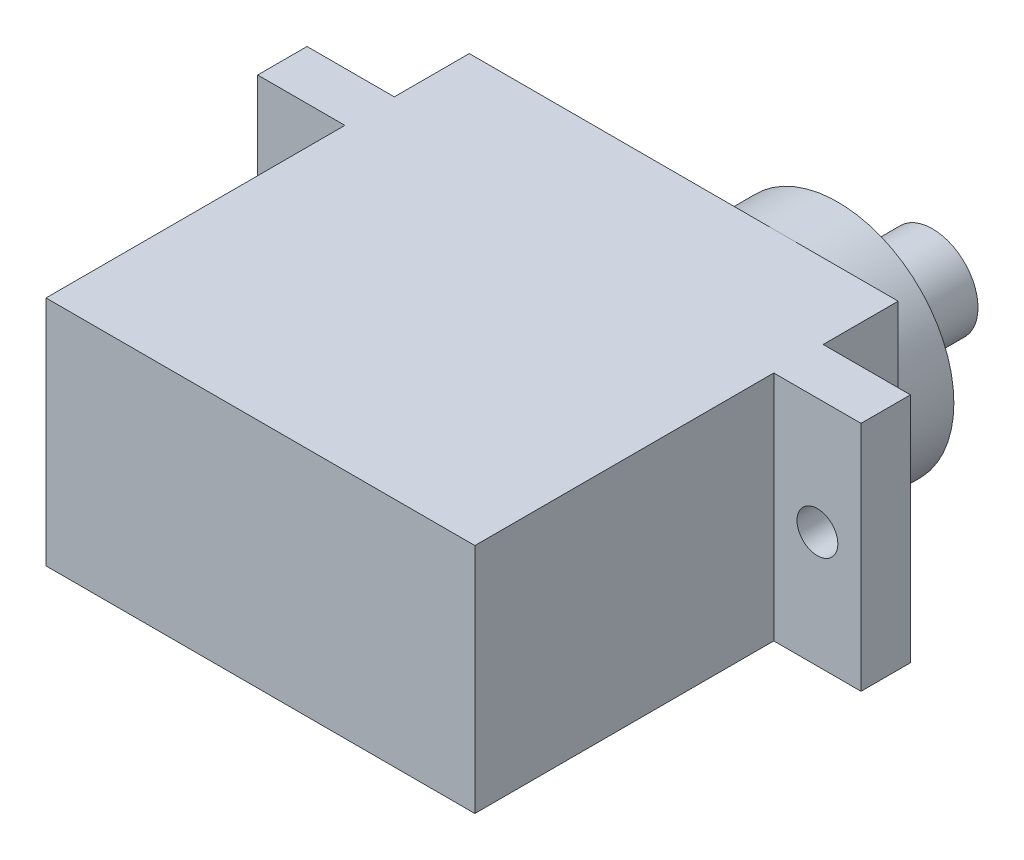
ISO-10303-21;
HEADER;
FILE_DESCRIPTION(('STEP AP214'),'2;1');
FILE_NAME('part.step','',(''),(''),'','','');
FILE_SCHEMA(('AUTOMOTIVE_DESIGN { 1 0 10303 214 1 1 1 1 }'));
ENDSEC;
DATA;
#1=APPLICATION_CONTEXT('core data for automotive mechanical design processes');
#2=APPLICATION_PROTOCOL_DEFINITION('international standard','automotive_design',2000,#1);
#3=PRODUCT_CONTEXT('',#1,'mechanical');
#4=PRODUCT('Part','Part','',(#3));
#5=PRODUCT_RELATED_PRODUCT_CATEGORY('part','',(#4));
#6=PRODUCT_DEFINITION_FORMATION('','',#4);
#7=PRODUCT_DEFINITION_CONTEXT('part definition',#1,'design');
#8=PRODUCT_DEFINITION('design','',#6,#7);
#9=PRODUCT_DEFINITION_SHAPE('','',#8);
#10=(LENGTH_UNIT() NAMED_UNIT(*) SI_UNIT(.MILLI.,.METRE.));
#11=(NAMED_UNIT(*) PLANE_ANGLE_UNIT() SI_UNIT($,.RADIAN.));
#12=(NAMED_UNIT(*) SI_UNIT($,.STERADIAN.) SOLID_ANGLE_UNIT());
#13=UNCERTAINTY_MEASURE_WITH_UNIT(LENGTH_MEASURE(1.E-05),#10,'distance_accuracy_value','');
#14=(GEOMETRIC_REPRESENTATION_CONTEXT(3) GLOBAL_UNCERTAINTY_ASSIGNED_CONTEXT((#13)) GLOBAL_UNIT_ASSIGNED_CONTEXT((#10,
#11,#12)) REPRESENTATION_CONTEXT('',''));
#15=CARTESIAN_POINT('',(0.,0.,0.));
#16=DIRECTION('',(0.,0.,1.));
#17=DIRECTION('',(1.,0.,0.));
#18=AXIS2_PLACEMENT_3D('',#15,#16,#17);
#19=CARTESIAN_POINT('',(0.,0.,-6.7));
#20=DIRECTION('',(0.,0.,1.));
#21=DIRECTION('',(1.,0.,0.));
#22=AXIS2_PLACEMENT_3D('',#19,#20,#21);
#23=PLANE('',#22);
#24=DIRECTION('',(0.,1.,0.));
#25=VECTOR('',#24,1.);
#26=CARTESIAN_POINT('',(27.8,0.,-6.7));
#27=LINE('',#26,#25);
#28=CARTESIAN_POINT('',(27.8,6.25,-6.7));
#29=VERTEX_POINT('',#28);
#30=CARTESIAN_POINT('',(27.8,12.5,-6.7));
#31=VERTEX_POINT('',#30);
#32=EDGE_CURVE('E166',#29,#31,#27,.T.);
#33=ORIENTED_EDGE('',*,*,#32,.F.);
#34=CARTESIAN_POINT('',(21.55,6.25,-6.7));
#35=DIRECTION('',(0.,0.,1.));
#36=DIRECTION('',(1.,0.,0.));
#37=AXIS2_PLACEMENT_3D('',#34,#35,#36);
#38=CIRCLE('',#37,6.25);
#39=CARTESIAN_POINT('',(21.55,12.5,-6.7));
#40=VERTEX_POINT('',#39);
#41=EDGE_CURVE('E12',#29,#40,#38,.T.);
#42=ORIENTED_EDGE('',*,*,#41,.T.);
#43=DIRECTION('',(1.,0.,0.));
#44=VECTOR('',#43,1.);
#45=CARTESIAN_POINT('',(0.,12.5,-6.7));
#46=LINE('',#45,#44);
#47=EDGE_CURVE('E171',#40,#31,#46,.T.);
#48=ORIENTED_EDGE('',*,*,#47,.T.);
#49=EDGE_LOOP('',(#33,#42,#48));
#50=FACE_BOUND('',#49,.T.);
#51=ADVANCED_FACE('F39',(#50),#23,.F.);
#52=CARTESIAN_POINT('',(4.7,12.5,-6.7));
#53=VERTEX_POINT('',#52);
#54=EDGE_CURVE('E152',#53,#40,#46,.T.);
#55=ORIENTED_EDGE('',*,*,#54,.T.);
#56=CARTESIAN_POINT('',(21.55,0.,-6.7));
#57=VERTEX_POINT('',#56);
#58=EDGE_CURVE('E48',#40,#57,#38,.T.);
#59=ORIENTED_EDGE('',*,*,#58,.T.);
#60=DIRECTION('',(1.,0.,0.));
#61=VECTOR('',#60,1.);
#62=CARTESIAN_POINT('',(0.,0.,-6.7));
#63=LINE('',#62,#61);
#64=CARTESIAN_POINT('',(4.7,0.,-6.7));
#65=VERTEX_POINT('',#64);
#66=EDGE_CURVE('E150',#65,#57,#63,.T.);
#67=ORIENTED_EDGE('',*,*,#66,.F.);
#68=DIRECTION('',(0.,1.,0.));
#69=VECTOR('',#68,1.);
#70=CARTESIAN_POINT('',(4.7,0.,-6.7));
#71=LINE('',#70,#69);
#72=EDGE_CURVE('E173',#65,#53,#71,.T.);
#73=ORIENTED_EDGE('',*,*,#72,.T.);
#74=EDGE_LOOP('',(#55,#59,#67,#73));
#75=FACE_BOUND('',#74,.T.);
#76=ADVANCED_FACE('F148',(#75),#23,.F.);
#77=CARTESIAN_POINT('',(0.,0.,-2.66));
#78=DIRECTION('',(0.,0.,1.));
#79=DIRECTION('',(1.,0.,0.));
#80=AXIS2_PLACEMENT_3D('',#77,#78,#79);
#81=PLANE('',#80);
#82=CARTESIAN_POINT('',(2.12941164042014,6.25,-2.66));
#83=DIRECTION('',(0.,0.,-1.));
#84=DIRECTION('',(-1.,0.,0.));
#85=AXIS2_PLACEMENT_3D('',#82,#83,#84);
#86=CIRCLE('',#85,1.1);
#87=CARTESIAN_POINT('',(1.02941164042014,6.25,-2.66));
#88=VERTEX_POINT('',#87);
#89=EDGE_CURVE('E257',#88,#88,#86,.T.);
#90=ORIENTED_EDGE('',*,*,#89,.F.);
#91=EDGE_LOOP('',(#90));
#92=FACE_BOUND('',#91,.T.);
#93=DIRECTION('',(0.,1.,0.));
#94=VECTOR('',#93,1.);
#95=CARTESIAN_POINT('',(4.7,0.,-2.66));
#96=LINE('',#95,#94);
#97=CARTESIAN_POINT('',(4.7,0.,-2.66));
#98=VERTEX_POINT('',#97);
#99=CARTESIAN_POINT('',(4.7,12.5,-2.66));
#100=VERTEX_POINT('',#99);
#101=EDGE_CURVE('E177',#98,#100,#96,.T.);
#102=ORIENTED_EDGE('',*,*,#101,.F.);
#103=DIRECTION('',(1.,0.,0.));
#104=VECTOR('',#103,1.);
#105=CARTESIAN_POINT('',(0.,0.,-2.66));
#106=LINE('',#105,#104);
#107=CARTESIAN_POINT('',(0.,0.,-2.66));
#108=VERTEX_POINT('',#107);
#109=EDGE_CURVE('E198',#108,#98,#106,.T.);
#110=ORIENTED_EDGE('',*,*,#109,.F.);
#111=DIRECTION('',(0.,1.,0.));
#112=VECTOR('',#111,1.);
#113=CARTESIAN_POINT('',(0.,0.,-2.66));
#114=LINE('',#113,#112);
#115=CARTESIAN_POINT('',(0.,12.5,-2.66));
#116=VERTEX_POINT('',#115);
#117=EDGE_CURVE('E195',#108,#116,#114,.T.);
#118=ORIENTED_EDGE('',*,*,#117,.T.);
#119=DIRECTION('',(1.,0.,0.));
#120=VECTOR('',#119,1.);
#121=CARTESIAN_POINT('',(0.,12.5,-2.66));
#122=LINE('',#121,#120);
#123=EDGE_CURVE('E192',#116,#100,#122,.T.);
#124=ORIENTED_EDGE('',*,*,#123,.T.);
#125=EDGE_LOOP('',(#102,#110,#118,#124));
#126=FACE_BOUND('',#125,.T.);
#127=ADVANCED_FACE('F276',(#92,#126),#81,.F.);
#128=CARTESIAN_POINT('',(0.,0.,16.1));
#129=DIRECTION('',(0.,1.,0.));
#130=DIRECTION('',(0.,0.,1.));
#131=AXIS2_PLACEMENT_3D('',#128,#129,#130);
#132=PLANE('',#131);
#133=DIRECTION('',(0.,0.,-1.));
#134=VECTOR('',#133,1.);
#135=CARTESIAN_POINT('',(4.7,0.,16.1));
#136=LINE('',#135,#134);
#137=CARTESIAN_POINT('',(4.7,0.,16.1));
#138=VERTEX_POINT('',#137);
#139=CARTESIAN_POINT('',(4.7,0.,0.));
#140=VERTEX_POINT('',#139);
#141=EDGE_CURVE('E233',#138,#140,#136,.T.);
#142=ORIENTED_EDGE('',*,*,#141,.T.);
#143=DIRECTION('',(1.,0.,0.));
#144=VECTOR('',#143,1.);
#145=CARTESIAN_POINT('',(0.,0.,0.));
#146=LINE('',#145,#144);
#147=CARTESIAN_POINT('',(0.,0.,0.));
#148=VERTEX_POINT('',#147);
#149=EDGE_CURVE('E191',#148,#140,#146,.T.);
#150=ORIENTED_EDGE('',*,*,#149,.F.);
#151=DIRECTION('',(0.,0.,1.));
#152=VECTOR('',#151,1.);
#153=CARTESIAN_POINT('',(0.,0.,-2.66));
#154=LINE('',#153,#152);
#155=EDGE_CURVE('E214',#108,#148,#154,.T.);
#156=ORIENTED_EDGE('',*,*,#155,.F.);
#157=ORIENTED_EDGE('',*,*,#109,.T.);
#158=DIRECTION('',(0.,0.,1.));
#159=VECTOR('',#158,1.);
#160=CARTESIAN_POINT('',(4.7,0.,-6.7));
#161=LINE('',#160,#159);
#162=EDGE_CURVE('E164',#65,#98,#161,.T.);
#163=ORIENTED_EDGE('',*,*,#162,.F.);
#164=ORIENTED_EDGE('',*,*,#66,.T.);
#165=CARTESIAN_POINT('',(27.8,0.,-6.7));
#166=VERTEX_POINT('',#165);
#167=EDGE_CURVE('E153',#57,#166,#63,.T.);
#168=ORIENTED_EDGE('',*,*,#167,.T.);
#169=DIRECTION('',(0.,0.,1.));
#170=VECTOR('',#169,1.);
#171=CARTESIAN_POINT('',(27.8,0.,-6.7));
#172=LINE('',#171,#170);
#173=CARTESIAN_POINT('',(27.8,0.,-2.66));
#174=VERTEX_POINT('',#173);
#175=EDGE_CURVE('E175',#166,#174,#172,.T.);
#176=ORIENTED_EDGE('',*,*,#175,.T.);
#177=CARTESIAN_POINT('',(32.5,0.,-2.66));
#178=VERTEX_POINT('',#177);
#179=EDGE_CURVE('E197',#174,#178,#106,.T.);
#180=ORIENTED_EDGE('',*,*,#179,.T.);
#181=DIRECTION('',(0.,0.,1.));
#182=VECTOR('',#181,1.);
#183=CARTESIAN_POINT('',(32.5,0.,-2.66));
#184=LINE('',#183,#182);
#185=CARTESIAN_POINT('',(32.5,0.,0.));
#186=VERTEX_POINT('',#185);
#187=EDGE_CURVE('E211',#178,#186,#184,.T.);
#188=ORIENTED_EDGE('',*,*,#187,.T.);
#189=CARTESIAN_POINT('',(27.8,0.,0.));
#190=VERTEX_POINT('',#189);
#191=EDGE_CURVE('E209',#190,#186,#146,.T.);
#192=ORIENTED_EDGE('',*,*,#191,.F.);
#193=DIRECTION('',(0.,0.,-1.));
#194=VECTOR('',#193,1.);
#195=CARTESIAN_POINT('',(27.8,0.,16.1));
#196=LINE('',#195,#194);
#197=CARTESIAN_POINT('',(27.8,0.,16.1));
#198=VERTEX_POINT('',#197);
#199=EDGE_CURVE('E244',#198,#190,#196,.T.);
#200=ORIENTED_EDGE('',*,*,#199,.F.);
#201=DIRECTION('',(1.,0.,0.));
#202=VECTOR('',#201,1.);
#203=CARTESIAN_POINT('',(0.,0.,16.1));
#204=LINE('',#203,#202);
#205=EDGE_CURVE('E221',#138,#198,#204,.T.);
#206=ORIENTED_EDGE('',*,*,#205,.F.);
#207=EDGE_LOOP('',(#142,#150,#156,#157,#163,#164,#168,#176,#180,#188,#192,#200,#206));
#208=FACE_BOUND('',#207,.T.);
#209=ADVANCED_FACE('F41',(#208),#132,.F.);
#210=CARTESIAN_POINT('',(27.8,0.,16.1));
#211=DIRECTION('',(-1.,0.,0.));
#212=DIRECTION('',(0.,0.,1.));
#213=AXIS2_PLACEMENT_3D('',#210,#211,#212);
#214=PLANE('',#213);
#215=DIRECTION('',(0.,1.,0.));
#216=VECTOR('',#215,1.);
#217=CARTESIAN_POINT('',(27.8,0.,0.));
#218=LINE('',#217,#216);
#219=CARTESIAN_POINT('',(27.8,6.25,0.));
#220=VERTEX_POINT('',#219);
#221=EDGE_CURVE('E234',#190,#220,#218,.T.);
#222=ORIENTED_EDGE('',*,*,#221,.T.);
#223=CARTESIAN_POINT('',(27.8,12.5,0.));
#224=VERTEX_POINT('',#223);
#225=EDGE_CURVE('E57',#220,#224,#218,.T.);
#226=ORIENTED_EDGE('',*,*,#225,.T.);
#227=DIRECTION('',(0.,0.,-1.));
#228=VECTOR('',#227,1.);
#229=CARTESIAN_POINT('',(27.8,12.5,16.1));
#230=LINE('',#229,#228);
#231=CARTESIAN_POINT('',(27.8,12.5,16.1));
#232=VERTEX_POINT('',#231);
#233=EDGE_CURVE('E241',#232,#224,#230,.T.);
#234=ORIENTED_EDGE('',*,*,#233,.F.);
#235=DIRECTION('',(0.,1.,0.));
#236=VECTOR('',#235,1.);
#237=CARTESIAN_POINT('',(27.8,0.,16.1));
#238=LINE('',#237,#236);
#239=EDGE_CURVE('E224',#198,#232,#238,.T.);
#240=ORIENTED_EDGE('',*,*,#239,.F.);
#241=ORIENTED_EDGE('',*,*,#199,.T.);
#242=EDGE_LOOP('',(#222,#226,#234,#240,#241));
#243=FACE_BOUND('',#242,.T.);
#244=ADVANCED_FACE('F289',(#243),#214,.F.);
#245=CARTESIAN_POINT('',(0.,12.5,16.1));
#246=DIRECTION('',(0.,1.,0.));
#247=DIRECTION('',(0.,0.,1.));
#248=AXIS2_PLACEMENT_3D('',#245,#246,#247);
#249=PLANE('',#248);
#250=ORIENTED_EDGE('',*,*,#233,.T.);
#251=DIRECTION('',(1.,0.,0.));
#252=VECTOR('',#251,1.);
#253=CARTESIAN_POINT('',(0.,12.5,0.));
#254=LINE('',#253,#252);
#255=CARTESIAN_POINT('',(32.5,12.5,0.));
#256=VERTEX_POINT('',#255);
#257=EDGE_CURVE('E203',#224,#256,#254,.T.);
#258=ORIENTED_EDGE('',*,*,#257,.T.);
#259=DIRECTION('',(0.,0.,1.));
#260=VECTOR('',#259,1.);
#261=CARTESIAN_POINT('',(32.5,12.5,-2.66));
#262=LINE('',#261,#260);
#263=CARTESIAN_POINT('',(32.5,12.5,-2.66));
#264=VERTEX_POINT('',#263);
#265=EDGE_CURVE('E200',#264,#256,#262,.T.);
#266=ORIENTED_EDGE('',*,*,#265,.F.);
#267=CARTESIAN_POINT('',(27.8,12.5,-2.66));
#268=VERTEX_POINT('',#267);
#269=EDGE_CURVE('E190',#268,#264,#122,.T.);
#270=ORIENTED_EDGE('',*,*,#269,.F.);
#271=DIRECTION('',(0.,0.,1.));
#272=VECTOR('',#271,1.);
#273=CARTESIAN_POINT('',(27.8,12.5,-6.7));
#274=LINE('',#273,#272);
#275=EDGE_CURVE('E181',#31,#268,#274,.T.);
#276=ORIENTED_EDGE('',*,*,#275,.F.);
#277=ORIENTED_EDGE('',*,*,#47,.F.);
#278=ORIENTED_EDGE('',*,*,#54,.F.);
#279=DIRECTION('',(0.,0.,1.));
#280=VECTOR('',#279,1.);
#281=CARTESIAN_POINT('',(4.7,12.5,-6.7));
#282=LINE('',#281,#280);
#283=EDGE_CURVE('E178',#53,#100,#282,.T.);
#284=ORIENTED_EDGE('',*,*,#283,.T.);
#285=ORIENTED_EDGE('',*,*,#123,.F.);
#286=DIRECTION('',(0.,0.,1.));
#287=VECTOR('',#286,1.);
#288=CARTESIAN_POINT('',(0.,12.5,-2.66));
#289=LINE('',#288,#287);
#290=CARTESIAN_POINT('',(0.,12.5,0.));
#291=VERTEX_POINT('',#290);
#292=EDGE_CURVE('E216',#116,#291,#289,.T.);
#293=ORIENTED_EDGE('',*,*,#292,.T.);
#294=CARTESIAN_POINT('',(4.7,12.5,0.));
#295=VERTEX_POINT('',#294);
#296=EDGE_CURVE('E204',#291,#295,#254,.T.);
#297=ORIENTED_EDGE('',*,*,#296,.T.);
#298=DIRECTION('',(0.,0.,-1.));
#299=VECTOR('',#298,1.);
#300=CARTESIAN_POINT('',(4.7,12.5,16.1));
#301=LINE('',#300,#299);
#302=CARTESIAN_POINT('',(4.7,12.5,16.1));
#303=VERTEX_POINT('',#302);
#304=EDGE_CURVE('E238',#303,#295,#301,.T.);
#305=ORIENTED_EDGE('',*,*,#304,.F.);
#306=DIRECTION('',(1.,0.,0.));
#307=VECTOR('',#306,1.);
#308=CARTESIAN_POINT('',(0.,12.5,16.1));
#309=LINE('',#308,#307);
#310=EDGE_CURVE('E227',#303,#232,#309,.T.);
#311=ORIENTED_EDGE('',*,*,#310,.T.);
#312=EDGE_LOOP('',(#250,#258,#266,#270,#276,#277,#278,#284,#285,#293,#297,#305,#311));
#313=FACE_BOUND('',#312,.T.);
#314=ADVANCED_FACE('F303',(#313),#249,.T.);
#315=CARTESIAN_POINT('',(4.7,0.,16.1));
#316=DIRECTION('',(-1.,0.,0.));
#317=DIRECTION('',(0.,0.,1.));
#318=AXIS2_PLACEMENT_3D('',#315,#316,#317);
#319=PLANE('',#318);
#320=DIRECTION('',(0.,1.,0.));
#321=VECTOR('',#320,1.);
#322=CARTESIAN_POINT('',(4.7,0.,0.));
#323=LINE('',#322,#321);
#324=EDGE_CURVE('E225',#140,#295,#323,.T.);
#325=ORIENTED_EDGE('',*,*,#324,.F.);
#326=ORIENTED_EDGE('',*,*,#141,.F.);
#327=DIRECTION('',(0.,1.,0.));
#328=VECTOR('',#327,1.);
#329=CARTESIAN_POINT('',(4.7,0.,16.1));
#330=LINE('',#329,#328);
#331=EDGE_CURVE('E230',#138,#303,#330,.T.);
#332=ORIENTED_EDGE('',*,*,#331,.T.);
#333=ORIENTED_EDGE('',*,*,#304,.T.);
#334=EDGE_LOOP('',(#325,#326,#332,#333));
#335=FACE_BOUND('',#334,.T.);
#336=ADVANCED_FACE('F298',(#335),#319,.T.);
#337=CARTESIAN_POINT('',(0.,0.,16.1));
#338=DIRECTION('',(0.,0.,1.));
#339=DIRECTION('',(1.,0.,0.));
#340=AXIS2_PLACEMENT_3D('',#337,#338,#339);
#341=PLANE('',#340);
#342=ORIENTED_EDGE('',*,*,#205,.T.);
#343=ORIENTED_EDGE('',*,*,#239,.T.);
#344=ORIENTED_EDGE('',*,*,#310,.F.);
#345=ORIENTED_EDGE('',*,*,#331,.F.);
#346=EDGE_LOOP('',(#342,#343,#344,#345));
#347=FACE_BOUND('',#346,.T.);
#348=ADVANCED_FACE('F294',(#347),#341,.T.);
#349=CARTESIAN_POINT('',(0.,0.,0.));
#350=DIRECTION('',(0.,0.,1.));
#351=DIRECTION('',(1.,0.,0.));
#352=AXIS2_PLACEMENT_3D('',#349,#350,#351);
#353=PLANE('',#352);
#354=CARTESIAN_POINT('',(30.15,6.25,0.));
#355=DIRECTION('',(0.,0.,1.));
#356=DIRECTION('',(1.,0.,0.));
#357=AXIS2_PLACEMENT_3D('',#354,#355,#356);
#358=CIRCLE('',#357,1.1);
#359=CARTESIAN_POINT('',(31.25,6.25,0.));
#360=VERTEX_POINT('',#359);
#361=EDGE_CURVE('E261',#360,#360,#358,.T.);
#362=ORIENTED_EDGE('',*,*,#361,.F.);
#363=EDGE_LOOP('',(#362));
#364=FACE_BOUND('',#363,.T.);
#365=ORIENTED_EDGE('',*,*,#221,.F.);
#366=ORIENTED_EDGE('',*,*,#191,.T.);
#367=DIRECTION('',(0.,1.,0.));
#368=VECTOR('',#367,1.);
#369=CARTESIAN_POINT('',(32.5,0.,0.));
#370=LINE('',#369,#368);
#371=EDGE_CURVE('E186',#186,#256,#370,.T.);
#372=ORIENTED_EDGE('',*,*,#371,.T.);
#373=ORIENTED_EDGE('',*,*,#257,.F.);
#374=ORIENTED_EDGE('',*,*,#225,.F.);
#375=EDGE_LOOP('',(#365,#366,#372,#373,#374));
#376=FACE_BOUND('',#375,.T.);
#377=ADVANCED_FACE('F285',(#364,#376),#353,.T.);
#378=CARTESIAN_POINT('',(32.5,0.,-2.66));
#379=DIRECTION('',(1.,0.,0.));
#380=DIRECTION('',(0.,0.,-1.));
#381=AXIS2_PLACEMENT_3D('',#378,#379,#380);
#382=PLANE('',#381);
#383=ORIENTED_EDGE('',*,*,#371,.F.);
#384=ORIENTED_EDGE('',*,*,#187,.F.);
#385=DIRECTION('',(0.,1.,0.));
#386=VECTOR('',#385,1.);
#387=CARTESIAN_POINT('',(32.5,0.,-2.66));
#388=LINE('',#387,#386);
#389=EDGE_CURVE('E187',#178,#264,#388,.T.);
#390=ORIENTED_EDGE('',*,*,#389,.T.);
#391=ORIENTED_EDGE('',*,*,#265,.T.);
#392=EDGE_LOOP('',(#383,#384,#390,#391));
#393=FACE_BOUND('',#392,.T.);
#394=ADVANCED_FACE('F283',(#393),#382,.T.);
#395=CARTESIAN_POINT('',(0.,0.,-2.66));
#396=DIRECTION('',(1.,0.,0.));
#397=DIRECTION('',(0.,0.,-1.));
#398=AXIS2_PLACEMENT_3D('',#395,#396,#397);
#399=PLANE('',#398);
#400=DIRECTION('',(0.,1.,0.));
#401=VECTOR('',#400,1.);
#402=CARTESIAN_POINT('',(0.,0.,0.));
#403=LINE('',#402,#401);
#404=EDGE_CURVE('E207',#148,#291,#403,.T.);
#405=ORIENTED_EDGE('',*,*,#404,.T.);
#406=ORIENTED_EDGE('',*,*,#292,.F.);
#407=ORIENTED_EDGE('',*,*,#117,.F.);
#408=ORIENTED_EDGE('',*,*,#155,.T.);
#409=EDGE_LOOP('',(#405,#406,#407,#408));
#410=FACE_BOUND('',#409,.T.);
#411=ADVANCED_FACE('F274',(#410),#399,.F.);
#412=CARTESIAN_POINT('',(30.15,6.25,-2.66));
#413=DIRECTION('',(0.,0.,-1.));
#414=DIRECTION('',(-1.,0.,0.));
#415=AXIS2_PLACEMENT_3D('',#412,#413,#414);
#416=CIRCLE('',#415,1.1);
#417=CARTESIAN_POINT('',(29.05,6.25,-2.66));
#418=VERTEX_POINT('',#417);
#419=EDGE_CURVE('E264',#418,#418,#416,.T.);
#420=ORIENTED_EDGE('',*,*,#419,.F.);
#421=EDGE_LOOP('',(#420));
#422=FACE_BOUND('',#421,.T.);
#423=ORIENTED_EDGE('',*,*,#179,.F.);
#424=DIRECTION('',(0.,1.,0.));
#425=VECTOR('',#424,1.);
#426=CARTESIAN_POINT('',(27.8,0.,-2.66));
#427=LINE('',#426,#425);
#428=EDGE_CURVE('E144',#174,#268,#427,.T.);
#429=ORIENTED_EDGE('',*,*,#428,.T.);
#430=ORIENTED_EDGE('',*,*,#269,.T.);
#431=ORIENTED_EDGE('',*,*,#389,.F.);
#432=EDGE_LOOP('',(#423,#429,#430,#431));
#433=FACE_BOUND('',#432,.T.);
#434=ADVANCED_FACE('F270',(#422,#433),#81,.F.);
#435=CARTESIAN_POINT('',(2.12941164042014,6.25,0.));
#436=DIRECTION('',(0.,0.,1.));
#437=DIRECTION('',(1.,0.,0.));
#438=AXIS2_PLACEMENT_3D('',#435,#436,#437);
#439=CIRCLE('',#438,1.1);
#440=CARTESIAN_POINT('',(3.22941164042014,6.25,0.));
#441=VERTEX_POINT('',#440);
#442=EDGE_CURVE('E43',#441,#441,#439,.T.);
#443=ORIENTED_EDGE('',*,*,#442,.F.);
#444=EDGE_LOOP('',(#443));
#445=FACE_BOUND('',#444,.T.);
#446=ORIENTED_EDGE('',*,*,#149,.T.);
#447=ORIENTED_EDGE('',*,*,#324,.T.);
#448=ORIENTED_EDGE('',*,*,#296,.F.);
#449=ORIENTED_EDGE('',*,*,#404,.F.);
#450=EDGE_LOOP('',(#446,#447,#448,#449));
#451=FACE_BOUND('',#450,.T.);
#452=ADVANCED_FACE('F273',(#445,#451),#353,.T.);
#453=CARTESIAN_POINT('',(27.8,0.,-6.7));
#454=DIRECTION('',(1.,0.,0.));
#455=DIRECTION('',(0.,0.,-1.));
#456=AXIS2_PLACEMENT_3D('',#453,#454,#455);
#457=PLANE('',#456);
#458=ORIENTED_EDGE('',*,*,#275,.T.);
#459=ORIENTED_EDGE('',*,*,#428,.F.);
#460=ORIENTED_EDGE('',*,*,#175,.F.);
#461=EDGE_CURVE('E156',#166,#29,#27,.T.);
#462=ORIENTED_EDGE('',*,*,#461,.T.);
#463=ORIENTED_EDGE('',*,*,#32,.T.);
#464=EDGE_LOOP('',(#458,#459,#460,#462,#463));
#465=FACE_BOUND('',#464,.T.);
#466=ADVANCED_FACE('F320',(#465),#457,.T.);
#467=CARTESIAN_POINT('',(4.7,0.,-6.7));
#468=DIRECTION('',(1.,0.,0.));
#469=DIRECTION('',(0.,0.,-1.));
#470=AXIS2_PLACEMENT_3D('',#467,#468,#469);
#471=PLANE('',#470);
#472=ORIENTED_EDGE('',*,*,#162,.T.);
#473=ORIENTED_EDGE('',*,*,#101,.T.);
#474=ORIENTED_EDGE('',*,*,#283,.F.);
#475=ORIENTED_EDGE('',*,*,#72,.F.);
#476=EDGE_LOOP('',(#472,#473,#474,#475));
#477=FACE_BOUND('',#476,.T.);
#478=ADVANCED_FACE('F313',(#477),#471,.F.);
#479=ORIENTED_EDGE('',*,*,#167,.F.);
#480=EDGE_CURVE('E50',#57,#29,#38,.T.);
#481=ORIENTED_EDGE('',*,*,#480,.T.);
#482=ORIENTED_EDGE('',*,*,#461,.F.);
#483=EDGE_LOOP('',(#479,#481,#482));
#484=FACE_BOUND('',#483,.T.);
#485=ADVANCED_FACE('F154',(#484),#23,.F.);
#486=CARTESIAN_POINT('',(21.55,6.25,-30.3776695296637));
#487=DIRECTION('',(0.,0.,1.));
#488=DIRECTION('',(1.,0.,0.));
#489=AXIS2_PLACEMENT_3D('',#486,#487,#488);
#490=CYLINDRICAL_SURFACE('',#489,6.25);
#491=CARTESIAN_POINT('',(21.55,6.25,-9.7));
#492=DIRECTION('',(0.,0.,1.));
#493=DIRECTION('',(1.,0.,0.));
#494=AXIS2_PLACEMENT_3D('',#491,#492,#493);
#495=CIRCLE('',#494,6.25);
#496=CARTESIAN_POINT('',(27.8,6.25,-9.7));
#497=VERTEX_POINT('',#496);
#498=EDGE_CURVE('E160',#497,#497,#495,.F.);
#499=ORIENTED_EDGE('',*,*,#498,.F.);
#500=EDGE_LOOP('',(#499));
#501=FACE_BOUND('',#500,.T.);
#502=ORIENTED_EDGE('',*,*,#41,.F.);
#503=ORIENTED_EDGE('',*,*,#480,.F.);
#504=ORIENTED_EDGE('',*,*,#58,.F.);
#505=EDGE_LOOP('',(#502,#503,#504));
#506=FACE_BOUND('',#505,.T.);
#507=ADVANCED_FACE('F139',(#501,#506),#490,.T.);
#508=CARTESIAN_POINT('',(0.,0.,-9.7));
#509=DIRECTION('',(0.,0.,1.));
#510=DIRECTION('',(1.,0.,0.));
#511=AXIS2_PLACEMENT_3D('',#508,#509,#510);
#512=PLANE('',#511);
#513=CARTESIAN_POINT('',(21.55,6.25,-9.7));
#514=DIRECTION('',(0.,0.,1.));
#515=DIRECTION('',(1.,0.,0.));
#516=AXIS2_PLACEMENT_3D('',#513,#514,#515);
#517=CIRCLE('',#516,2.45);
#518=CARTESIAN_POINT('',(24.,6.25,-9.7));
#519=VERTEX_POINT('',#518);
#520=EDGE_CURVE('E247',#519,#519,#517,.T.);
#521=ORIENTED_EDGE('',*,*,#520,.T.);
#522=EDGE_LOOP('',(#521));
#523=FACE_BOUND('',#522,.T.);
#524=ORIENTED_EDGE('',*,*,#498,.T.);
#525=EDGE_LOOP('',(#524));
#526=FACE_BOUND('',#525,.T.);
#527=ADVANCED_FACE('F340',(#523,#526),#512,.F.);
#528=CARTESIAN_POINT('',(21.55,6.25,-14.8));
#529=DIRECTION('',(0.,0.,1.));
#530=DIRECTION('',(1.,0.,0.));
#531=AXIS2_PLACEMENT_3D('',#528,#529,#530);
#532=CYLINDRICAL_SURFACE('',#531,2.45);
#533=CARTESIAN_POINT('',(21.55,6.25,-14.8));
#534=DIRECTION('',(0.,0.,1.));
#535=DIRECTION('',(1.,0.,0.));
#536=AXIS2_PLACEMENT_3D('',#533,#534,#535);
#537=CIRCLE('',#536,2.45);
#538=CARTESIAN_POINT('',(24.,6.25,-14.8));
#539=VERTEX_POINT('',#538);
#540=EDGE_CURVE('E249',#539,#539,#537,.T.);
#541=ORIENTED_EDGE('',*,*,#540,.T.);
#542=EDGE_LOOP('',(#541));
#543=FACE_BOUND('',#542,.T.);
#544=ORIENTED_EDGE('',*,*,#520,.F.);
#545=EDGE_LOOP('',(#544));
#546=FACE_BOUND('',#545,.T.);
#547=ADVANCED_FACE('F345',(#543,#546),#532,.T.);
#548=CARTESIAN_POINT('',(0.,0.,-14.8));
#549=DIRECTION('',(0.,0.,1.));
#550=DIRECTION('',(1.,0.,0.));
#551=AXIS2_PLACEMENT_3D('',#548,#549,#550);
#552=PLANE('',#551);
#553=ORIENTED_EDGE('',*,*,#540,.F.);
#554=EDGE_LOOP('',(#553));
#555=FACE_BOUND('',#554,.T.);
#556=ADVANCED_FACE('F351',(#555),#552,.F.);
#557=CARTESIAN_POINT('',(2.12941164042014,6.25,12.14));
#558=DIRECTION('',(0.,0.,-1.));
#559=DIRECTION('',(-1.,0.,0.));
#560=AXIS2_PLACEMENT_3D('',#557,#558,#559);
#561=CYLINDRICAL_SURFACE('',#560,1.1);
#562=ORIENTED_EDGE('',*,*,#442,.T.);
#563=EDGE_LOOP('',(#562));
#564=FACE_BOUND('',#563,.T.);
#565=ORIENTED_EDGE('',*,*,#89,.T.);
#566=EDGE_LOOP('',(#565));
#567=FACE_BOUND('',#566,.T.);
#568=ADVANCED_FACE('F354',(#564,#567),#561,.F.);
#569=CARTESIAN_POINT('',(30.15,6.25,12.14));
#570=DIRECTION('',(0.,0.,-1.));
#571=DIRECTION('',(-1.,0.,0.));
#572=AXIS2_PLACEMENT_3D('',#569,#570,#571);
#573=CYLINDRICAL_SURFACE('',#572,1.1);
#574=ORIENTED_EDGE('',*,*,#361,.T.);
#575=EDGE_LOOP('',(#574));
#576=FACE_BOUND('',#575,.T.);
#577=ORIENTED_EDGE('',*,*,#419,.T.);
#578=EDGE_LOOP('',(#577));
#579=FACE_BOUND('',#578,.T.);
#580=ADVANCED_FACE('F268',(#576,#579),#573,.F.);
#581=CLOSED_SHELL('',(#51,#76,#127,#209,#244,#314,#336,#348,#377,#394,#411,#434,#452,#466,#478,
#485,#507,#527,#547,#556,#568,#580));
#582=MANIFOLD_SOLID_BREP('B2',#581);
#583=ADVANCED_BREP_SHAPE_REPRESENTATION('',(#18,#582),#14);
#584=SHAPE_DEFINITION_REPRESENTATION(#9,#583);
ENDSEC;
END-ISO-10303-21;
